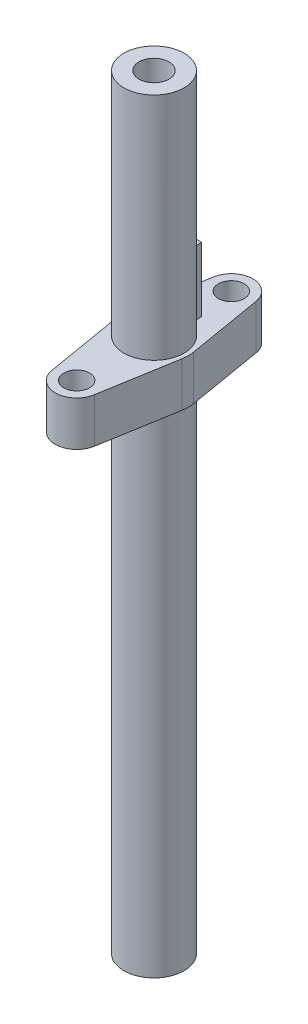
ISO-10303-21;
HEADER;
FILE_DESCRIPTION(('STEP AP214'),'2;1');
FILE_NAME('part.step','',(''),(''),'','','');
FILE_SCHEMA(('AUTOMOTIVE_DESIGN { 1 0 10303 214 1 1 1 1 }'));
ENDSEC;
DATA;
#1=APPLICATION_CONTEXT('core data for automotive mechanical design processes');
#2=APPLICATION_PROTOCOL_DEFINITION('international standard','automotive_design',2000,#1);
#3=PRODUCT_CONTEXT('',#1,'mechanical');
#4=PRODUCT('Part','Part','',(#3));
#5=PRODUCT_RELATED_PRODUCT_CATEGORY('part','',(#4));
#6=PRODUCT_DEFINITION_FORMATION('','',#4);
#7=PRODUCT_DEFINITION_CONTEXT('part definition',#1,'design');
#8=PRODUCT_DEFINITION('design','',#6,#7);
#9=PRODUCT_DEFINITION_SHAPE('','',#8);
#10=(LENGTH_UNIT() NAMED_UNIT(*) SI_UNIT(.MILLI.,.METRE.));
#11=(NAMED_UNIT(*) PLANE_ANGLE_UNIT() SI_UNIT($,.RADIAN.));
#12=(NAMED_UNIT(*) SI_UNIT($,.STERADIAN.) SOLID_ANGLE_UNIT());
#13=UNCERTAINTY_MEASURE_WITH_UNIT(LENGTH_MEASURE(1.E-05),#10,'distance_accuracy_value','');
#14=(GEOMETRIC_REPRESENTATION_CONTEXT(3) GLOBAL_UNCERTAINTY_ASSIGNED_CONTEXT((#13)) GLOBAL_UNIT_ASSIGNED_CONTEXT((#10,
#11,#12)) REPRESENTATION_CONTEXT('',''));
#15=CARTESIAN_POINT('',(0.,0.,0.));
#16=DIRECTION('',(0.,0.,1.));
#17=DIRECTION('',(1.,0.,0.));
#18=AXIS2_PLACEMENT_3D('',#15,#16,#17);
#19=CARTESIAN_POINT('',(0.,87.927,0.));
#20=DIRECTION('',(0.,-1.,0.));
#21=DIRECTION('',(0.,0.,-1.));
#22=AXIS2_PLACEMENT_3D('',#19,#20,#21);
#23=CYLINDRICAL_SURFACE('',#22,3.5);
#24=CARTESIAN_POINT('',(0.,55.977,0.));
#25=DIRECTION('',(0.,-1.,0.));
#26=DIRECTION('',(0.,0.,-1.));
#27=AXIS2_PLACEMENT_3D('',#24,#25,#26);
#28=CIRCLE('',#27,3.5);
#29=CARTESIAN_POINT('',(0.,55.977,-3.5));
#30=VERTEX_POINT('',#29);
#31=EDGE_CURVE('E293',#30,#30,#28,.T.);
#32=ORIENTED_EDGE('',*,*,#31,.T.);
#33=EDGE_LOOP('',(#32));
#34=FACE_BOUND('',#33,.T.);
#35=CARTESIAN_POINT('',(-3.03108891324554,4.677,1.75));
#36=CARTESIAN_POINT('',(-3.03109685774804,4.58581133565831,1.74999363538043));
#37=CARTESIAN_POINT('',(-3.03526652078574,4.49450752983117,1.74282494878313));
#38=CARTESIAN_POINT('',(-3.05134141291092,4.31470228681498,1.71451561732159));
#39=CARTESIAN_POINT('',(-3.06326289597229,4.22620714867404,1.69334561296981));
#40=CARTESIAN_POINT('',(-3.09311356559447,4.0549595873981,1.63817491022467));
#41=CARTESIAN_POINT('',(-3.11101076078191,3.97217935817122,1.60424241686403));
#42=CARTESIAN_POINT('',(-3.15074663429501,3.81350764650574,1.52471816940865));
#43=CARTESIAN_POINT('',(-3.17258552583113,3.7376165370407,1.4791257845626));
#44=CARTESIAN_POINT('',(-3.21994520850522,3.58796497502437,1.37316644592904));
#45=CARTESIAN_POINT('',(-3.24562111366419,3.5148965125713,1.3118910632516));
#46=CARTESIAN_POINT('',(-3.29650969874985,3.37953532028826,1.17819416332532));
#47=CARTESIAN_POINT('',(-3.32172214204687,3.31724796547884,1.10576712011901));
#48=CARTESIAN_POINT('',(-3.37087584667661,3.20110748549159,0.945856735975454));
#49=CARTESIAN_POINT('',(-3.39461686231802,3.14810590624582,0.857687580772005));
#50=CARTESIAN_POINT('',(-3.43613823174176,3.05800350681992,0.672274796549131));
#51=CARTESIAN_POINT('',(-3.45392234571548,3.02089265175995,0.575036941741771));
#52=CARTESIAN_POINT('',(-3.48040807177416,2.96636684272308,0.381578651870459));
#53=CARTESIAN_POINT('',(-3.48966590386561,2.94773832887782,0.28577813335543));
#54=CARTESIAN_POINT('',(-3.50013271730617,2.92670929231869,0.0919986002212335));
#55=CARTESIAN_POINT('',(-3.50134656873032,2.92429895060751,-0.00597906022654291));
#56=CARTESIAN_POINT('',(-3.49585218353788,2.93530667944811,-0.192206917741563));
#57=CARTESIAN_POINT('',(-3.48982367811281,2.94736652716214,-0.280562098559385));
#58=CARTESIAN_POINT('',(-3.47154929204558,2.98454147683315,-0.453799100857064));
#59=CARTESIAN_POINT('',(-3.45930294616189,3.00965755570839,-0.53868066191437));
#60=CARTESIAN_POINT('',(-3.42950270753395,3.07239449065717,-0.704041435246719));
#61=CARTESIAN_POINT('',(-3.41187772676098,3.11018354805112,-0.784443491151563));
#62=CARTESIAN_POINT('',(-3.37290880476702,3.19696097835262,-0.937959402648325));
#63=CARTESIAN_POINT('',(-3.35156353275597,3.24595336077911,-1.01107063546763));
#64=CARTESIAN_POINT('',(-3.30477690198651,3.35906686518278,-1.15530390657184));
#65=CARTESIAN_POINT('',(-3.27913907996806,3.42418029957052,-1.22558463130138));
#66=CARTESIAN_POINT('',(-3.2279509602692,3.56503201862781,-1.35468264802112));
#67=CARTESIAN_POINT('',(-3.2024007446485,3.64077840147961,-1.4134911202549));
#68=CARTESIAN_POINT('',(-3.15252273161848,3.80663433674216,-1.52163433562387));
#69=CARTESIAN_POINT('',(-3.12837559983738,3.89735054034487,-1.57013030121159));
#70=CARTESIAN_POINT('',(-3.08657037987508,4.08714092487825,-1.65080844775215));
#71=CARTESIAN_POINT('',(-3.06890552580618,4.18620625778074,-1.68300765186906));
#72=CARTESIAN_POINT('',(-3.0440311267981,4.38162539474489,-1.72756536929382));
#73=CARTESIAN_POINT('',(-3.03610397734869,4.47757195832622,-1.74129396370996));
#74=CARTESIAN_POINT('',(-3.02956358882817,4.67070234765395,-1.75265465657));
#75=CARTESIAN_POINT('',(-3.03094377056295,4.76788525095963,-1.75029812530129));
#76=CARTESIAN_POINT('',(-3.04210088946024,4.94939435751278,-1.73081307585194));
#77=CARTESIAN_POINT('',(-3.05094278136645,5.03396403943888,-1.71532867924682));
#78=CARTESIAN_POINT('',(-3.07464537714847,5.19914362597418,-1.67246849810677));
#79=CARTESIAN_POINT('',(-3.08950803008809,5.27975223880657,-1.64508886259132));
#80=CARTESIAN_POINT('',(-3.12438388639399,5.43896982907972,-1.57788328005855));
#81=CARTESIAN_POINT('',(-3.14460375675361,5.51731327949372,-1.53753961146226));
#82=CARTESIAN_POINT('',(-3.18773209120187,5.66657122519324,-1.44600236202766));
#83=CARTESIAN_POINT('',(-3.21064193371508,5.73748187614825,-1.39480320758138));
#84=CARTESIAN_POINT('',(-3.26003997298588,5.87921284316621,-1.27546504259799));
#85=CARTESIAN_POINT('',(-3.28661520520006,5.9488950137559,-1.20600422655119));
#86=CARTESIAN_POINT('',(-3.33784911211312,6.07597141648878,-1.055957866947));
#87=CARTESIAN_POINT('',(-3.36250713763491,6.13336149790345,-0.975368580646856));
#88=CARTESIAN_POINT('',(-3.40797382959175,6.23550402041268,-0.802436884477823));
#89=CARTESIAN_POINT('',(-3.42866372926051,6.27988295686909,-0.709840420754696));
#90=CARTESIAN_POINT('',(-3.46295871178777,6.35199133175044,-0.517164138121892));
#91=CARTESIAN_POINT('',(-3.47657001433653,6.37973538989103,-0.417090977436306));
#92=CARTESIAN_POINT('',(-3.49418139318295,6.41539498730566,-0.222214444078229));
#93=CARTESIAN_POINT('',(-3.49894873839335,6.4248962827832,-0.127770026738298));
#94=CARTESIAN_POINT('',(-3.5007372815648,6.4284757145452,0.0614704754146075));
#95=CARTESIAN_POINT('',(-3.49776119117057,6.42255924991624,0.156266425516403));
#96=CARTESIAN_POINT('',(-3.48484445466365,6.39652128810766,0.336941486555008));
#97=CARTESIAN_POINT('',(-3.47537565668982,6.37736151379907,0.422996556169713));
#98=CARTESIAN_POINT('',(-3.45086163910991,6.3266777512198,0.590530416321332));
#99=CARTESIAN_POINT('',(-3.43581561982392,6.29515198983646,0.672008548672141));
#100=CARTESIAN_POINT('',(-3.4007037880921,6.21922765870954,0.831990960928549));
#101=CARTESIAN_POINT('',(-3.38045080097898,6.17433618438628,0.910218999725081));
#102=CARTESIAN_POINT('',(-3.33704232998196,6.07357362099666,1.05835562317454));
#103=CARTESIAN_POINT('',(-3.31388551477131,6.01769748904757,1.12826036297609));
#104=CARTESIAN_POINT('',(-3.26425067896598,5.89010500671027,1.26509950727456));
#105=CARTESIAN_POINT('',(-3.23767148270471,5.81736564691491,1.33104594794373));
#106=CARTESIAN_POINT('',(-3.18610383284992,5.6614612380229,1.45016075294068));
#107=CARTESIAN_POINT('',(-3.16111680083264,5.57828706348155,1.5033178125176));
#108=CARTESIAN_POINT('',(-3.11499309283603,5.40038586848333,1.5967543896249));
#109=CARTESIAN_POINT('',(-3.09400304948473,5.30537682052471,1.63657386543164));
#110=CARTESIAN_POINT('',(-3.06015773574615,5.10866829240539,1.69903774163622));
#111=CARTESIAN_POINT('',(-3.04727528258478,5.0069924444028,1.72173958455686));
#112=CARTESIAN_POINT('',(-3.03676227053133,4.866340627609,1.74014226376272));
#113=CARTESIAN_POINT('',(-3.03464225759016,4.8286061848037,1.74383318368674));
#114=CARTESIAN_POINT('',(-3.03180387803563,4.75292115880607,1.74876345890743));
#115=CARTESIAN_POINT('',(-3.03108560518941,4.71497056132472,1.75000265019977));
#116=CARTESIAN_POINT('',(-3.03108891324554,4.677,1.75));
#117=B_SPLINE_CURVE_WITH_KNOTS('',3,(#35,#36,#37,#38,#39,#40,#41,#42,#43,#44,#45,#46,#47,#48,
#49,#50,#51,#52,#53,#54,#55,#56,#57,#58,#59,#60,#61,#62,#63,#64,#65,#66,#67,#68,#69,#70,#71,#72,
#73,#74,#75,#76,#77,#78,#79,#80,#81,#82,#83,#84,#85,#86,#87,#88,#89,#90,#91,#92,#93,#94,#95,#96,
#97,#98,#99,#100,#101,#102,#103,#104,#105,#106,#107,#108,#109,#110,#111,#112,#113,#114,#115,
#116),.UNSPECIFIED.,.T.,.F.,(4,2,2,2,2,2,2,2,2,2,2,2,2,2,2,2,2,2,2,2,2,2,2,2,2,2,2,2,2,2,2,2,2,
2,2,2,2,2,2,2,4),(0.,0.273406214540752,0.547387562443408,0.81992504285805,1.09247726952901,
1.38750904687191,1.68268749397649,1.99776311417836,2.31263947186809,2.60511098693886,
2.8974054145057,3.16428170597942,3.43117796905546,3.70176685779507,3.97245273862976,
4.26872585049558,4.56522584430357,4.88055473026535,5.19555354870483,5.4855900899487,
5.77542163079653,6.03354820992044,6.2917584176311,6.56192768710653,6.83223600885083,
7.13661801266073,7.44110263711853,7.7536231747269,8.0658686466535,8.34946473181602,
8.6329615188945,8.89777743525111,9.16263133646022,9.43881313759075,9.71512202676258,
10.0189292323762,10.3230039997902,10.6366881081756,10.9493148275483,11.0631523657429,
11.1769975186545),.UNSPECIFIED.);
#118=CARTESIAN_POINT('',(-3.03108891324554,4.677,1.75));
#119=VERTEX_POINT('',#118);
#120=EDGE_CURVE('E229',#119,#119,#117,.T.);
#121=ORIENTED_EDGE('',*,*,#120,.T.);
#122=EDGE_LOOP('',(#121));
#123=FACE_BOUND('',#122,.T.);
#124=CARTESIAN_POINT('',(0.,-1.1,0.));
#125=DIRECTION('',(0.,-1.,0.));
#126=DIRECTION('',(0.,0.,-1.));
#127=AXIS2_PLACEMENT_3D('',#124,#125,#126);
#128=CIRCLE('',#127,3.5);
#129=CARTESIAN_POINT('',(0.,-1.1,-3.5));
#130=VERTEX_POINT('',#129);
#131=EDGE_CURVE('E330',#130,#130,#128,.T.);
#132=ORIENTED_EDGE('',*,*,#131,.F.);
#133=EDGE_LOOP('',(#132));
#134=FACE_BOUND('',#133,.T.);
#135=ADVANCED_FACE('F45',(#34,#123,#134),#23,.T.);
#136=CARTESIAN_POINT('',(0.,8.9,0.));
#137=DIRECTION('',(0.,-1.,0.));
#138=DIRECTION('',(0.,0.,-1.));
#139=AXIS2_PLACEMENT_3D('',#136,#137,#138);
#140=CYLINDRICAL_SURFACE('',#139,1.75);
#141=CARTESIAN_POINT('',(0.,7.427,0.));
#142=DIRECTION('',(0.,-1.,0.));
#143=DIRECTION('',(0.,0.,-1.));
#144=AXIS2_PLACEMENT_3D('',#141,#142,#143);
#145=CIRCLE('',#144,1.75);
#146=CARTESIAN_POINT('',(0.,7.427,-1.75));
#147=VERTEX_POINT('',#146);
#148=EDGE_CURVE('E651',#147,#147,#145,.T.);
#149=ORIENTED_EDGE('',*,*,#148,.F.);
#150=EDGE_LOOP('',(#149));
#151=FACE_BOUND('',#150,.T.);
#152=CARTESIAN_POINT('',(0.,4.677,0.));
#153=DIRECTION('',(-0.707106781186547,0.707106781186547,0.));
#154=DIRECTION('',(-0.707106781186547,-0.707106781186547,0.));
#155=AXIS2_PLACEMENT_3D('',#152,#153,#154);
#156=ELLIPSE('',#155,2.47487373415292,1.75);
#157=CARTESIAN_POINT('',(0.,4.677,1.75));
#158=VERTEX_POINT('',#157);
#159=CARTESIAN_POINT('',(0.,4.677,-1.75));
#160=VERTEX_POINT('',#159);
#161=EDGE_CURVE('E213',#158,#160,#156,.F.);
#162=ORIENTED_EDGE('',*,*,#161,.F.);
#163=CARTESIAN_POINT('',(0.,4.677,0.));
#164=DIRECTION('',(-0.707106781186547,-0.707106781186547,0.));
#165=DIRECTION('',(-0.707106781186547,0.707106781186547,0.));
#166=AXIS2_PLACEMENT_3D('',#163,#164,#165);
#167=ELLIPSE('',#166,2.47487373415292,1.75);
#168=EDGE_CURVE('E68',#160,#158,#167,.F.);
#169=ORIENTED_EDGE('',*,*,#168,.F.);
#170=EDGE_LOOP('',(#162,#169));
#171=FACE_BOUND('',#170,.T.);
#172=CARTESIAN_POINT('',(0.,-1.1,0.));
#173=DIRECTION('',(0.,-1.,0.));
#174=DIRECTION('',(0.,0.,-1.));
#175=AXIS2_PLACEMENT_3D('',#172,#173,#174);
#176=CIRCLE('',#175,1.75);
#177=CARTESIAN_POINT('',(0.,-1.1,-1.75));
#178=VERTEX_POINT('',#177);
#179=EDGE_CURVE('E326',#178,#178,#176,.F.);
#180=ORIENTED_EDGE('',*,*,#179,.F.);
#181=EDGE_LOOP('',(#180));
#182=FACE_BOUND('',#181,.T.);
#183=ADVANCED_FACE('F250',(#151,#171,#182),#140,.F.);
#184=CARTESIAN_POINT('',(3.501,4.677,0.));
#185=DIRECTION('',(-1.,0.,0.));
#186=DIRECTION('',(0.,0.,1.));
#187=AXIS2_PLACEMENT_3D('',#184,#185,#186);
#188=CYLINDRICAL_SURFACE('',#187,1.75);
#189=ORIENTED_EDGE('',*,*,#161,.T.);
#190=ORIENTED_EDGE('',*,*,#168,.T.);
#191=EDGE_LOOP('',(#189,#190));
#192=FACE_BOUND('',#191,.T.);
#193=ORIENTED_EDGE('',*,*,#120,.F.);
#194=EDGE_LOOP('',(#193));
#195=FACE_BOUND('',#194,.T.);
#196=ADVANCED_FACE('F242',(#192,#195),#188,.F.);
#197=CARTESIAN_POINT('',(0.,55.977,0.));
#198=DIRECTION('',(0.,-1.,0.));
#199=DIRECTION('',(0.,0.,-1.));
#200=AXIS2_PLACEMENT_3D('',#197,#198,#199);
#201=PLANE('',#200);
#202=ORIENTED_EDGE('',*,*,#31,.F.);
#203=EDGE_LOOP('',(#202));
#204=FACE_BOUND('',#203,.T.);
#205=CARTESIAN_POINT('',(0.,55.977,0.));
#206=DIRECTION('',(0.,-1.,0.));
#207=DIRECTION('',(0.,0.,-1.));
#208=AXIS2_PLACEMENT_3D('',#205,#206,#207);
#209=CIRCLE('',#208,4.);
#210=CARTESIAN_POINT('',(-3.94405318873308,55.977,0.666666666666666));
#211=VERTEX_POINT('',#210);
#212=CARTESIAN_POINT('',(-3.94405318873308,55.977,-0.666666666666668));
#213=VERTEX_POINT('',#212);
#214=EDGE_CURVE('E160',#211,#213,#209,.T.);
#215=ORIENTED_EDGE('',*,*,#214,.T.);
#216=DIRECTION('',(0.166666666666667,0.,-0.986013297183269));
#217=VECTOR('',#216,1.);
#218=CARTESIAN_POINT('',(-3.94405318873308,55.977,-0.666666666666668));
#219=LINE('',#218,#217);
#220=CARTESIAN_POINT('',(-2.46503324295805,55.977,-9.41666666666665));
#221=VERTEX_POINT('',#220);
#222=EDGE_CURVE('E148',#213,#221,#219,.T.);
#223=ORIENTED_EDGE('',*,*,#222,.T.);
#224=CARTESIAN_POINT('',(1.2490009027033E-13,55.977,-9.));
#225=DIRECTION('',(0.,-1.,0.));
#226=DIRECTION('',(0.,0.,1.));
#227=AXIS2_PLACEMENT_3D('',#224,#225,#226);
#228=CIRCLE('',#227,2.5);
#229=CARTESIAN_POINT('',(2.46503324295818,55.977,-9.41666666666667));
#230=VERTEX_POINT('',#229);
#231=EDGE_CURVE('E159',#221,#230,#228,.T.);
#232=ORIENTED_EDGE('',*,*,#231,.T.);
#233=DIRECTION('',(0.166666666666666,0.,0.986013297183269));
#234=VECTOR('',#233,1.);
#235=CARTESIAN_POINT('',(2.46503324295818,55.977,-9.41666666666667));
#236=LINE('',#235,#234);
#237=CARTESIAN_POINT('',(3.94405318873308,55.977,-0.666666666666666));
#238=VERTEX_POINT('',#237);
#239=EDGE_CURVE('E356',#230,#238,#236,.T.);
#240=ORIENTED_EDGE('',*,*,#239,.T.);
#241=CARTESIAN_POINT('',(0.,55.977,0.));
#242=DIRECTION('',(0.,-1.,0.));
#243=DIRECTION('',(0.,0.,-1.));
#244=AXIS2_PLACEMENT_3D('',#241,#242,#243);
#245=CIRCLE('',#244,4.);
#246=CARTESIAN_POINT('',(3.94405318873308,55.977,0.666666666666666));
#247=VERTEX_POINT('',#246);
#248=EDGE_CURVE('E359',#238,#247,#245,.T.);
#249=ORIENTED_EDGE('',*,*,#248,.T.);
#250=DIRECTION('',(-0.166666666666667,0.,0.986013297183269));
#251=VECTOR('',#250,1.);
#252=CARTESIAN_POINT('',(2.46503324295817,55.977,9.41666666666667));
#253=LINE('',#252,#251);
#254=CARTESIAN_POINT('',(2.46503324295817,55.977,9.41666666666667));
#255=VERTEX_POINT('',#254);
#256=EDGE_CURVE('E362',#247,#255,#253,.T.);
#257=ORIENTED_EDGE('',*,*,#256,.T.);
#258=CARTESIAN_POINT('',(0.,55.977,9.));
#259=DIRECTION('',(0.,-1.,0.));
#260=DIRECTION('',(0.,0.,-1.));
#261=AXIS2_PLACEMENT_3D('',#258,#259,#260);
#262=CIRCLE('',#261,2.5);
#263=CARTESIAN_POINT('',(-2.46503324295817,55.977,9.41666666666667));
#264=VERTEX_POINT('',#263);
#265=EDGE_CURVE('E365',#255,#264,#262,.T.);
#266=ORIENTED_EDGE('',*,*,#265,.T.);
#267=DIRECTION('',(-0.166666666666667,0.,-0.986013297183269));
#268=VECTOR('',#267,1.);
#269=CARTESIAN_POINT('',(-3.94405318873308,55.977,0.666666666666666));
#270=LINE('',#269,#268);
#271=EDGE_CURVE('E166',#264,#211,#270,.T.);
#272=ORIENTED_EDGE('',*,*,#271,.T.);
#273=EDGE_LOOP('',(#215,#223,#232,#240,#249,#257,#266,#272));
#274=FACE_BOUND('',#273,.T.);
#275=CARTESIAN_POINT('',(0.,55.977,9.));
#276=DIRECTION('',(0.,-1.,0.));
#277=DIRECTION('',(0.,0.,-1.));
#278=AXIS2_PLACEMENT_3D('',#275,#276,#277);
#279=CIRCLE('',#278,1.5);
#280=CARTESIAN_POINT('',(0.,55.977,7.5));
#281=VERTEX_POINT('',#280);
#282=EDGE_CURVE('E347',#281,#281,#279,.T.);
#283=ORIENTED_EDGE('',*,*,#282,.F.);
#284=EDGE_LOOP('',(#283));
#285=FACE_BOUND('',#284,.T.);
#286=CARTESIAN_POINT('',(1.2490009027033E-13,55.977,-9.));
#287=DIRECTION('',(0.,-1.,0.));
#288=DIRECTION('',(0.,0.,1.));
#289=AXIS2_PLACEMENT_3D('',#286,#287,#288);
#290=CIRCLE('',#289,1.5);
#291=CARTESIAN_POINT('',(1.2490009027033E-13,55.977,-7.5));
#292=VERTEX_POINT('',#291);
#293=EDGE_CURVE('E294',#292,#292,#290,.T.);
#294=ORIENTED_EDGE('',*,*,#293,.F.);
#295=EDGE_LOOP('',(#294));
#296=FACE_BOUND('',#295,.T.);
#297=ADVANCED_FACE('F163',(#204,#274,#285,#296),#201,.T.);
#298=CARTESIAN_POINT('',(0.,61.177,0.));
#299=DIRECTION('',(0.,-1.,0.));
#300=DIRECTION('',(0.,0.,-1.));
#301=AXIS2_PLACEMENT_3D('',#298,#299,#300);
#302=PLANE('',#301);
#303=DIRECTION('',(0.,0.,1.));
#304=VECTOR('',#303,1.);
#305=CARTESIAN_POINT('',(-0.850000000000001,61.177,-3.24037034920393));
#306=LINE('',#305,#304);
#307=CARTESIAN_POINT('',(-0.850000000000001,61.177,-4.70410196624969));
#308=VERTEX_POINT('',#307);
#309=CARTESIAN_POINT('',(-0.850000000000001,61.177,-3.39521722427299));
#310=VERTEX_POINT('',#309);
#311=EDGE_CURVE('E195',#308,#310,#306,.T.);
#312=ORIENTED_EDGE('',*,*,#311,.F.);
#313=DIRECTION('',(-1.,0.,0.));
#314=VECTOR('',#313,1.);
#315=CARTESIAN_POINT('',(-0.850000000000001,61.177,-4.70410196624969));
#316=LINE('',#315,#314);
#317=CARTESIAN_POINT('',(0.850000000000001,61.177,-4.70410196624969));
#318=VERTEX_POINT('',#317);
#319=EDGE_CURVE('E191',#318,#308,#316,.T.);
#320=ORIENTED_EDGE('',*,*,#319,.F.);
#321=DIRECTION('',(0.,0.,-1.));
#322=VECTOR('',#321,1.);
#323=CARTESIAN_POINT('',(0.850000000000003,61.177,-3.24037034920393));
#324=LINE('',#323,#322);
#325=CARTESIAN_POINT('',(0.850000000000003,61.177,-3.39521722427299));
#326=VERTEX_POINT('',#325);
#327=EDGE_CURVE('E187',#326,#318,#324,.T.);
#328=ORIENTED_EDGE('',*,*,#327,.F.);
#329=CARTESIAN_POINT('',(0.,61.177,0.));
#330=DIRECTION('',(0.,-1.,0.));
#331=DIRECTION('',(0.,0.,-1.));
#332=AXIS2_PLACEMENT_3D('',#329,#330,#331);
#333=CIRCLE('',#332,3.5);
#334=EDGE_CURVE('E288',#326,#310,#333,.T.);
#335=ORIENTED_EDGE('',*,*,#334,.T.);
#336=EDGE_LOOP('',(#312,#320,#328,#335));
#337=FACE_BOUND('',#336,.T.);
#338=CARTESIAN_POINT('',(0.,61.177,0.));
#339=DIRECTION('',(0.,-1.,0.));
#340=DIRECTION('',(0.,0.,-1.));
#341=AXIS2_PLACEMENT_3D('',#338,#339,#340);
#342=CIRCLE('',#341,4.);
#343=CARTESIAN_POINT('',(-3.94405318873308,61.177,0.666666666666666));
#344=VERTEX_POINT('',#343);
#345=CARTESIAN_POINT('',(-3.94405318873308,61.177,-0.666666666666668));
#346=VERTEX_POINT('',#345);
#347=EDGE_CURVE('E175',#344,#346,#342,.T.);
#348=ORIENTED_EDGE('',*,*,#347,.F.);
#349=DIRECTION('',(-0.166666666666667,0.,-0.986013297183269));
#350=VECTOR('',#349,1.);
#351=CARTESIAN_POINT('',(-3.94405318873308,61.177,0.666666666666666));
#352=LINE('',#351,#350);
#353=CARTESIAN_POINT('',(-2.46503324295817,61.177,9.41666666666667));
#354=VERTEX_POINT('',#353);
#355=EDGE_CURVE('E171',#354,#344,#352,.T.);
#356=ORIENTED_EDGE('',*,*,#355,.F.);
#357=CARTESIAN_POINT('',(0.,61.177,9.));
#358=DIRECTION('',(0.,-1.,0.));
#359=DIRECTION('',(0.,0.,-1.));
#360=AXIS2_PLACEMENT_3D('',#357,#358,#359);
#361=CIRCLE('',#360,2.5);
#362=CARTESIAN_POINT('',(2.46503324295817,61.177,9.41666666666667));
#363=VERTEX_POINT('',#362);
#364=EDGE_CURVE('E388',#363,#354,#361,.T.);
#365=ORIENTED_EDGE('',*,*,#364,.F.);
#366=DIRECTION('',(-0.166666666666667,0.,0.986013297183269));
#367=VECTOR('',#366,1.);
#368=CARTESIAN_POINT('',(2.46503324295817,61.177,9.41666666666667));
#369=LINE('',#368,#367);
#370=CARTESIAN_POINT('',(3.94405318873308,61.177,0.666666666666666));
#371=VERTEX_POINT('',#370);
#372=EDGE_CURVE('E385',#371,#363,#369,.T.);
#373=ORIENTED_EDGE('',*,*,#372,.F.);
#374=CARTESIAN_POINT('',(0.,61.177,0.));
#375=DIRECTION('',(0.,-1.,0.));
#376=DIRECTION('',(0.,0.,-1.));
#377=AXIS2_PLACEMENT_3D('',#374,#375,#376);
#378=CIRCLE('',#377,4.);
#379=CARTESIAN_POINT('',(3.94405318873308,61.177,-0.666666666666666));
#380=VERTEX_POINT('',#379);
#381=EDGE_CURVE('E382',#380,#371,#378,.T.);
#382=ORIENTED_EDGE('',*,*,#381,.F.);
#383=DIRECTION('',(0.166666666666666,0.,0.986013297183269));
#384=VECTOR('',#383,1.);
#385=CARTESIAN_POINT('',(2.46503324295818,61.177,-9.41666666666667));
#386=LINE('',#385,#384);
#387=CARTESIAN_POINT('',(2.46503324295818,61.177,-9.41666666666667));
#388=VERTEX_POINT('',#387);
#389=EDGE_CURVE('E379',#388,#380,#386,.T.);
#390=ORIENTED_EDGE('',*,*,#389,.F.);
#391=CARTESIAN_POINT('',(1.2490009027033E-13,61.177,-9.));
#392=DIRECTION('',(0.,-1.,0.));
#393=DIRECTION('',(0.,0.,1.));
#394=AXIS2_PLACEMENT_3D('',#391,#392,#393);
#395=CIRCLE('',#394,2.5);
#396=CARTESIAN_POINT('',(-2.46503324295805,61.177,-9.41666666666665));
#397=VERTEX_POINT('',#396);
#398=EDGE_CURVE('E376',#397,#388,#395,.T.);
#399=ORIENTED_EDGE('',*,*,#398,.F.);
#400=DIRECTION('',(0.166666666666667,0.,-0.986013297183269));
#401=VECTOR('',#400,1.);
#402=CARTESIAN_POINT('',(-3.94405318873308,61.177,-0.666666666666668));
#403=LINE('',#402,#401);
#404=EDGE_CURVE('E373',#346,#397,#403,.T.);
#405=ORIENTED_EDGE('',*,*,#404,.F.);
#406=EDGE_LOOP('',(#348,#356,#365,#373,#382,#390,#399,#405));
#407=FACE_BOUND('',#406,.T.);
#408=CARTESIAN_POINT('',(0.,61.177,9.));
#409=DIRECTION('',(0.,-1.,0.));
#410=DIRECTION('',(0.,0.,-1.));
#411=AXIS2_PLACEMENT_3D('',#408,#409,#410);
#412=CIRCLE('',#411,1.5);
#413=CARTESIAN_POINT('',(0.,61.177,7.5));
#414=VERTEX_POINT('',#413);
#415=EDGE_CURVE('E345',#414,#414,#412,.T.);
#416=ORIENTED_EDGE('',*,*,#415,.T.);
#417=EDGE_LOOP('',(#416));
#418=FACE_BOUND('',#417,.T.);
#419=CARTESIAN_POINT('',(1.2490009027033E-13,61.177,-9.));
#420=DIRECTION('',(0.,-1.,0.));
#421=DIRECTION('',(0.,0.,1.));
#422=AXIS2_PLACEMENT_3D('',#419,#420,#421);
#423=CIRCLE('',#422,1.5);
#424=CARTESIAN_POINT('',(1.2490009027033E-13,61.177,-7.5));
#425=VERTEX_POINT('',#424);
#426=EDGE_CURVE('E329',#425,#425,#423,.T.);
#427=ORIENTED_EDGE('',*,*,#426,.T.);
#428=EDGE_LOOP('',(#427));
#429=FACE_BOUND('',#428,.T.);
#430=ADVANCED_FACE('F319',(#337,#407,#418,#429),#302,.F.);
#431=CARTESIAN_POINT('',(0.,55.977,0.));
#432=DIRECTION('',(0.,1.,0.));
#433=DIRECTION('',(0.,0.,1.));
#434=AXIS2_PLACEMENT_3D('',#431,#432,#433);
#435=CYLINDRICAL_SURFACE('',#434,4.);
#436=ORIENTED_EDGE('',*,*,#347,.T.);
#437=DIRECTION('',(0.,1.,0.));
#438=VECTOR('',#437,1.);
#439=CARTESIAN_POINT('',(-3.94405318873308,55.977,-0.666666666666668));
#440=LINE('',#439,#438);
#441=EDGE_CURVE('E152',#213,#346,#440,.T.);
#442=ORIENTED_EDGE('',*,*,#441,.F.);
#443=ORIENTED_EDGE('',*,*,#214,.F.);
#444=DIRECTION('',(0.,1.,0.));
#445=VECTOR('',#444,1.);
#446=CARTESIAN_POINT('',(-3.94405318873308,55.977,0.666666666666666));
#447=LINE('',#446,#445);
#448=EDGE_CURVE('E370',#211,#344,#447,.T.);
#449=ORIENTED_EDGE('',*,*,#448,.T.);
#450=EDGE_LOOP('',(#436,#442,#443,#449));
#451=FACE_BOUND('',#450,.T.);
#452=ADVANCED_FACE('F173',(#451),#435,.T.);
#453=CARTESIAN_POINT('',(-3.94405318873308,55.977,-0.666666666666668));
#454=DIRECTION('',(0.986013297183269,0.,0.166666666666667));
#455=DIRECTION('',(0.166666666666667,0.,-0.986013297183269));
#456=AXIS2_PLACEMENT_3D('',#453,#454,#455);
#457=PLANE('',#456);
#458=ORIENTED_EDGE('',*,*,#404,.T.);
#459=DIRECTION('',(0.,1.,0.));
#460=VECTOR('',#459,1.);
#461=CARTESIAN_POINT('',(-2.46503324295805,55.977,-9.41666666666665));
#462=LINE('',#461,#460);
#463=EDGE_CURVE('E155',#221,#397,#462,.T.);
#464=ORIENTED_EDGE('',*,*,#463,.F.);
#465=ORIENTED_EDGE('',*,*,#222,.F.);
#466=ORIENTED_EDGE('',*,*,#441,.T.);
#467=EDGE_LOOP('',(#458,#464,#465,#466));
#468=FACE_BOUND('',#467,.T.);
#469=ADVANCED_FACE('F150',(#468),#457,.F.);
#470=CARTESIAN_POINT('',(1.2490009027033E-13,55.977,-9.));
#471=DIRECTION('',(0.,1.,0.));
#472=DIRECTION('',(0.,0.,1.));
#473=AXIS2_PLACEMENT_3D('',#470,#471,#472);
#474=CYLINDRICAL_SURFACE('',#473,2.5);
#475=ORIENTED_EDGE('',*,*,#398,.T.);
#476=DIRECTION('',(0.,1.,0.));
#477=VECTOR('',#476,1.);
#478=CARTESIAN_POINT('',(2.46503324295818,55.977,-9.41666666666667));
#479=LINE('',#478,#477);
#480=EDGE_CURVE('E183',#230,#388,#479,.T.);
#481=ORIENTED_EDGE('',*,*,#480,.F.);
#482=ORIENTED_EDGE('',*,*,#231,.F.);
#483=ORIENTED_EDGE('',*,*,#463,.T.);
#484=EDGE_LOOP('',(#475,#481,#482,#483));
#485=FACE_BOUND('',#484,.T.);
#486=ADVANCED_FACE('F435',(#485),#474,.T.);
#487=CARTESIAN_POINT('',(2.46503324295818,55.977,-9.41666666666667));
#488=DIRECTION('',(-0.986013297183269,0.,0.166666666666666));
#489=DIRECTION('',(0.166666666666666,0.,0.986013297183269));
#490=AXIS2_PLACEMENT_3D('',#487,#488,#489);
#491=PLANE('',#490);
#492=ORIENTED_EDGE('',*,*,#389,.T.);
#493=DIRECTION('',(0.,1.,0.));
#494=VECTOR('',#493,1.);
#495=CARTESIAN_POINT('',(3.94405318873308,55.977,-0.666666666666666));
#496=LINE('',#495,#494);
#497=EDGE_CURVE('E407',#238,#380,#496,.T.);
#498=ORIENTED_EDGE('',*,*,#497,.F.);
#499=ORIENTED_EDGE('',*,*,#239,.F.);
#500=ORIENTED_EDGE('',*,*,#480,.T.);
#501=EDGE_LOOP('',(#492,#498,#499,#500));
#502=FACE_BOUND('',#501,.T.);
#503=ADVANCED_FACE('F416',(#502),#491,.F.);
#504=CARTESIAN_POINT('',(0.,55.977,0.));
#505=DIRECTION('',(0.,1.,0.));
#506=DIRECTION('',(0.,0.,1.));
#507=AXIS2_PLACEMENT_3D('',#504,#505,#506);
#508=CYLINDRICAL_SURFACE('',#507,4.);
#509=ORIENTED_EDGE('',*,*,#381,.T.);
#510=DIRECTION('',(0.,1.,0.));
#511=VECTOR('',#510,1.);
#512=CARTESIAN_POINT('',(3.94405318873308,55.977,0.666666666666666));
#513=LINE('',#512,#511);
#514=EDGE_CURVE('E403',#247,#371,#513,.T.);
#515=ORIENTED_EDGE('',*,*,#514,.F.);
#516=ORIENTED_EDGE('',*,*,#248,.F.);
#517=ORIENTED_EDGE('',*,*,#497,.T.);
#518=EDGE_LOOP('',(#509,#515,#516,#517));
#519=FACE_BOUND('',#518,.T.);
#520=ADVANCED_FACE('F427',(#519),#508,.T.);
#521=CARTESIAN_POINT('',(2.46503324295817,55.977,9.41666666666667));
#522=DIRECTION('',(-0.986013297183269,0.,-0.166666666666667));
#523=DIRECTION('',(-0.166666666666667,0.,0.986013297183269));
#524=AXIS2_PLACEMENT_3D('',#521,#522,#523);
#525=PLANE('',#524);
#526=ORIENTED_EDGE('',*,*,#372,.T.);
#527=DIRECTION('',(0.,1.,0.));
#528=VECTOR('',#527,1.);
#529=CARTESIAN_POINT('',(2.46503324295817,55.977,9.41666666666667));
#530=LINE('',#529,#528);
#531=EDGE_CURVE('E399',#255,#363,#530,.T.);
#532=ORIENTED_EDGE('',*,*,#531,.F.);
#533=ORIENTED_EDGE('',*,*,#256,.F.);
#534=ORIENTED_EDGE('',*,*,#514,.T.);
#535=EDGE_LOOP('',(#526,#532,#533,#534));
#536=FACE_BOUND('',#535,.T.);
#537=ADVANCED_FACE('F431',(#536),#525,.F.);
#538=CARTESIAN_POINT('',(0.,55.977,9.));
#539=DIRECTION('',(0.,1.,0.));
#540=DIRECTION('',(0.,0.,1.));
#541=AXIS2_PLACEMENT_3D('',#538,#539,#540);
#542=CYLINDRICAL_SURFACE('',#541,2.5);
#543=ORIENTED_EDGE('',*,*,#364,.T.);
#544=DIRECTION('',(0.,1.,0.));
#545=VECTOR('',#544,1.);
#546=CARTESIAN_POINT('',(-2.46503324295817,55.977,9.41666666666667));
#547=LINE('',#546,#545);
#548=EDGE_CURVE('E395',#264,#354,#547,.T.);
#549=ORIENTED_EDGE('',*,*,#548,.F.);
#550=ORIENTED_EDGE('',*,*,#265,.F.);
#551=ORIENTED_EDGE('',*,*,#531,.T.);
#552=EDGE_LOOP('',(#543,#549,#550,#551));
#553=FACE_BOUND('',#552,.T.);
#554=ADVANCED_FACE('F544',(#553),#542,.T.);
#555=CARTESIAN_POINT('',(-3.94405318873308,55.977,0.666666666666666));
#556=DIRECTION('',(0.986013297183269,0.,-0.166666666666667));
#557=DIRECTION('',(-0.166666666666667,0.,-0.986013297183269));
#558=AXIS2_PLACEMENT_3D('',#555,#556,#557);
#559=PLANE('',#558);
#560=ORIENTED_EDGE('',*,*,#355,.T.);
#561=ORIENTED_EDGE('',*,*,#448,.F.);
#562=ORIENTED_EDGE('',*,*,#271,.F.);
#563=ORIENTED_EDGE('',*,*,#548,.T.);
#564=EDGE_LOOP('',(#560,#561,#562,#563));
#565=FACE_BOUND('',#564,.T.);
#566=ADVANCED_FACE('F537',(#565),#559,.F.);
#567=CARTESIAN_POINT('',(0.,55.977,9.));
#568=DIRECTION('',(0.,1.,0.));
#569=DIRECTION('',(0.,0.,1.));
#570=AXIS2_PLACEMENT_3D('',#567,#568,#569);
#571=CYLINDRICAL_SURFACE('',#570,1.5);
#572=ORIENTED_EDGE('',*,*,#282,.T.);
#573=EDGE_LOOP('',(#572));
#574=FACE_BOUND('',#573,.T.);
#575=ORIENTED_EDGE('',*,*,#415,.F.);
#576=EDGE_LOOP('',(#575));
#577=FACE_BOUND('',#576,.T.);
#578=ADVANCED_FACE('F534',(#574,#577),#571,.F.);
#579=CARTESIAN_POINT('',(1.2490009027033E-13,55.977,-9.));
#580=DIRECTION('',(0.,1.,0.));
#581=DIRECTION('',(0.,0.,1.));
#582=AXIS2_PLACEMENT_3D('',#579,#580,#581);
#583=CYLINDRICAL_SURFACE('',#582,1.5);
#584=ORIENTED_EDGE('',*,*,#293,.T.);
#585=EDGE_LOOP('',(#584));
#586=FACE_BOUND('',#585,.T.);
#587=ORIENTED_EDGE('',*,*,#426,.F.);
#588=EDGE_LOOP('',(#587));
#589=FACE_BOUND('',#588,.T.);
#590=ADVANCED_FACE('F248',(#586,#589),#583,.F.);
#591=CARTESIAN_POINT('',(0.,79.027,0.));
#592=DIRECTION('',(0.,1.,0.));
#593=DIRECTION('',(0.,0.,1.));
#594=AXIS2_PLACEMENT_3D('',#591,#592,#593);
#595=CYLINDRICAL_SURFACE('',#594,1.75);
#596=CARTESIAN_POINT('',(0.,79.427,0.));
#597=DIRECTION('',(0.,1.,0.));
#598=DIRECTION('',(0.,0.,1.));
#599=AXIS2_PLACEMENT_3D('',#596,#597,#598);
#600=CIRCLE('',#599,1.75);
#601=CARTESIAN_POINT('',(0.,79.427,1.75));
#602=VERTEX_POINT('',#601);
#603=EDGE_CURVE('E337',#602,#602,#600,.T.);
#604=ORIENTED_EDGE('',*,*,#603,.F.);
#605=EDGE_LOOP('',(#604));
#606=FACE_BOUND('',#605,.T.);
#607=CARTESIAN_POINT('',(0.,82.177,0.));
#608=DIRECTION('',(-0.707106781186547,-0.707106781186547,0.));
#609=DIRECTION('',(-0.707106781186547,0.707106781186547,0.));
#610=AXIS2_PLACEMENT_3D('',#607,#608,#609);
#611=ELLIPSE('',#610,2.47487373415292,1.75);
#612=CARTESIAN_POINT('',(0.,82.177,-1.75));
#613=VERTEX_POINT('',#612);
#614=CARTESIAN_POINT('',(0.,82.177,1.75));
#615=VERTEX_POINT('',#614);
#616=EDGE_CURVE('E214',#613,#615,#611,.F.);
#617=ORIENTED_EDGE('',*,*,#616,.F.);
#618=CARTESIAN_POINT('',(0.,82.177,0.));
#619=DIRECTION('',(-0.707106781186547,0.707106781186547,0.));
#620=DIRECTION('',(-0.707106781186547,-0.707106781186547,0.));
#621=AXIS2_PLACEMENT_3D('',#618,#619,#620);
#622=ELLIPSE('',#621,2.47487373415292,1.75);
#623=EDGE_CURVE('E207',#615,#613,#622,.F.);
#624=ORIENTED_EDGE('',*,*,#623,.F.);
#625=EDGE_LOOP('',(#617,#624));
#626=FACE_BOUND('',#625,.T.);
#627=CARTESIAN_POINT('',(0.,87.927,0.));
#628=DIRECTION('',(0.,1.,0.));
#629=DIRECTION('',(0.,0.,1.));
#630=AXIS2_PLACEMENT_3D('',#627,#628,#629);
#631=CIRCLE('',#630,1.75);
#632=CARTESIAN_POINT('',(0.,87.927,1.75));
#633=VERTEX_POINT('',#632);
#634=EDGE_CURVE('E305',#633,#633,#631,.T.);
#635=ORIENTED_EDGE('',*,*,#634,.T.);
#636=EDGE_LOOP('',(#635));
#637=FACE_BOUND('',#636,.T.);
#638=ADVANCED_FACE('F245',(#606,#626,#637),#595,.F.);
#639=CARTESIAN_POINT('',(0.,87.927,0.));
#640=DIRECTION('',(0.,1.,0.));
#641=DIRECTION('',(0.,0.,1.));
#642=AXIS2_PLACEMENT_3D('',#639,#640,#641);
#643=PLANE('',#642);
#644=ORIENTED_EDGE('',*,*,#634,.F.);
#645=EDGE_LOOP('',(#644));
#646=FACE_BOUND('',#645,.T.);
#647=CARTESIAN_POINT('',(0.,87.927,0.));
#648=DIRECTION('',(0.,1.,0.));
#649=DIRECTION('',(0.,0.,1.));
#650=AXIS2_PLACEMENT_3D('',#647,#648,#649);
#651=CIRCLE('',#650,3.5);
#652=CARTESIAN_POINT('',(0.,87.927,3.5));
#653=VERTEX_POINT('',#652);
#654=EDGE_CURVE('E285',#653,#653,#651,.T.);
#655=ORIENTED_EDGE('',*,*,#654,.T.);
#656=EDGE_LOOP('',(#655));
#657=FACE_BOUND('',#656,.T.);
#658=ADVANCED_FACE('F240',(#646,#657),#643,.T.);
#659=CARTESIAN_POINT('',(3.501,82.177,0.));
#660=DIRECTION('',(-1.,0.,0.));
#661=DIRECTION('',(0.,0.,1.));
#662=AXIS2_PLACEMENT_3D('',#659,#660,#661);
#663=CYLINDRICAL_SURFACE('',#662,1.75);
#664=ORIENTED_EDGE('',*,*,#623,.T.);
#665=ORIENTED_EDGE('',*,*,#616,.T.);
#666=EDGE_LOOP('',(#664,#665));
#667=FACE_BOUND('',#666,.T.);
#668=CARTESIAN_POINT('',(-3.03108891324553,82.177,1.75));
#669=CARTESIAN_POINT('',(-3.03109685774803,82.0858113356583,1.74999363538043));
#670=CARTESIAN_POINT('',(-3.03526652078574,81.9945075298312,1.74282494878313));
#671=CARTESIAN_POINT('',(-3.05134141291091,81.814702286815,1.7145156173216));
#672=CARTESIAN_POINT('',(-3.06326289597229,81.726207148674,1.69334561296982));
#673=CARTESIAN_POINT('',(-3.09311356559447,81.5549595873981,1.63817491022468));
#674=CARTESIAN_POINT('',(-3.11101076078191,81.4721793581712,1.60424241686404));
#675=CARTESIAN_POINT('',(-3.150746634295,81.3135076465058,1.52471816940866));
#676=CARTESIAN_POINT('',(-3.17258552583112,81.2376165370407,1.47912578456261));
#677=CARTESIAN_POINT('',(-3.21994520850522,81.0879649750244,1.37316644592905));
#678=CARTESIAN_POINT('',(-3.24562111366418,81.0148965125713,1.31189106325161));
#679=CARTESIAN_POINT('',(-3.29650969874984,80.8795353202883,1.17819416332533));
#680=CARTESIAN_POINT('',(-3.32172214204687,80.8172479654788,1.10576712011902));
#681=CARTESIAN_POINT('',(-3.37087584667661,80.7011074854916,0.945856735975462));
#682=CARTESIAN_POINT('',(-3.39461686231802,80.6481059062458,0.85768758077201));
#683=CARTESIAN_POINT('',(-3.43613823174176,80.5580035068199,0.672274796549137));
#684=CARTESIAN_POINT('',(-3.45392234571548,80.52089265176,0.575036941741779));
#685=CARTESIAN_POINT('',(-3.48040807177415,80.4663668427231,0.381578651870468));
#686=CARTESIAN_POINT('',(-3.48966590386561,80.4477383288778,0.285778133355437));
#687=CARTESIAN_POINT('',(-3.50013271730617,80.4267092923187,0.0919986002212391));
#688=CARTESIAN_POINT('',(-3.50134656873032,80.4242989506075,-0.00597906022653776));
#689=CARTESIAN_POINT('',(-3.49585218353788,80.4353066794481,-0.192206917741558));
#690=CARTESIAN_POINT('',(-3.48982367811281,80.4473665271621,-0.28056209855938));
#691=CARTESIAN_POINT('',(-3.47154929204558,80.4845414768331,-0.453799100857058));
#692=CARTESIAN_POINT('',(-3.45930294616189,80.5096575557084,-0.538680661914365));
#693=CARTESIAN_POINT('',(-3.42950270753395,80.5723944906572,-0.704041435246714));
#694=CARTESIAN_POINT('',(-3.41187772676099,80.6101835480511,-0.784443491151558));
#695=CARTESIAN_POINT('',(-3.37290880476703,80.6969609783526,-0.937959402648322));
#696=CARTESIAN_POINT('',(-3.35156353275597,80.7459533607791,-1.01107063546763));
#697=CARTESIAN_POINT('',(-3.30477690198651,80.8590668651828,-1.15530390657184));
#698=CARTESIAN_POINT('',(-3.27913907996807,80.9241802995705,-1.22558463130138));
#699=CARTESIAN_POINT('',(-3.2279509602692,81.0650320186278,-1.35468264802111));
#700=CARTESIAN_POINT('',(-3.2024007446485,81.1407784014796,-1.4134911202549));
#701=CARTESIAN_POINT('',(-3.15252273161848,81.3066343367421,-1.52163433562387));
#702=CARTESIAN_POINT('',(-3.12837559983738,81.3973505403449,-1.57013030121159));
#703=CARTESIAN_POINT('',(-3.08657037987508,81.5871409248782,-1.65080844775216));
#704=CARTESIAN_POINT('',(-3.06890552580618,81.6862062577807,-1.68300765186906));
#705=CARTESIAN_POINT('',(-3.0440311267981,81.8816253947449,-1.72756536929383));
#706=CARTESIAN_POINT('',(-3.03610397734868,81.9775719583262,-1.74129396370996));
#707=CARTESIAN_POINT('',(-3.02956358882816,82.170702347654,-1.75265465657));
#708=CARTESIAN_POINT('',(-3.03094377056295,82.2678852509596,-1.7502981253013));
#709=CARTESIAN_POINT('',(-3.04210088946023,82.4493943575128,-1.73081307585194));
#710=CARTESIAN_POINT('',(-3.05094278136645,82.5339640394389,-1.71532867924682));
#711=CARTESIAN_POINT('',(-3.07464537714847,82.6991436259742,-1.67246849810677));
#712=CARTESIAN_POINT('',(-3.08950803008809,82.7797522388066,-1.64508886259133));
#713=CARTESIAN_POINT('',(-3.12438388639399,82.9389698290797,-1.57788328005855));
#714=CARTESIAN_POINT('',(-3.1446037567536,83.0173132794937,-1.53753961146227));
#715=CARTESIAN_POINT('',(-3.18773209120187,83.1665712251932,-1.44600236202766));
#716=CARTESIAN_POINT('',(-3.21064193371508,83.2374818761482,-1.39480320758138));
#717=CARTESIAN_POINT('',(-3.26003997298588,83.3792128431662,-1.275465042598));
#718=CARTESIAN_POINT('',(-3.28661520520006,83.4488950137559,-1.2060042265512));
#719=CARTESIAN_POINT('',(-3.33784911211312,83.5759714164888,-1.05595786694701));
#720=CARTESIAN_POINT('',(-3.36250713763491,83.6333614979035,-0.975368580646863));
#721=CARTESIAN_POINT('',(-3.40797382959174,83.7355040204127,-0.802436884477831));
#722=CARTESIAN_POINT('',(-3.42866372926051,83.7798829568691,-0.709840420754706));
#723=CARTESIAN_POINT('',(-3.46295871178777,83.8519913317504,-0.517164138121902));
#724=CARTESIAN_POINT('',(-3.47657001433653,83.879735389891,-0.417090977436314));
#725=CARTESIAN_POINT('',(-3.49418139318295,83.9153949873057,-0.222214444078233));
#726=CARTESIAN_POINT('',(-3.49894873839335,83.9248962827832,-0.127770026738304));
#727=CARTESIAN_POINT('',(-3.5007372815648,83.9284757145452,0.061470475414602));
#728=CARTESIAN_POINT('',(-3.49776119117057,83.9225592499162,0.156266425516397));
#729=CARTESIAN_POINT('',(-3.48484445466365,83.8965212881077,0.336941486555002));
#730=CARTESIAN_POINT('',(-3.47537565668982,83.8773615137991,0.422996556169706));
#731=CARTESIAN_POINT('',(-3.45086163910991,83.8266777512198,0.590530416321327));
#732=CARTESIAN_POINT('',(-3.43581561982392,83.7951519898365,0.672008548672138));
#733=CARTESIAN_POINT('',(-3.4007037880921,83.7192276587096,0.831990960928545));
#734=CARTESIAN_POINT('',(-3.38045080097898,83.6743361843863,0.910218999725074));
#735=CARTESIAN_POINT('',(-3.33704232998196,83.5735736209967,1.05835562317454));
#736=CARTESIAN_POINT('',(-3.31388551477131,83.5176974890476,1.12826036297608));
#737=CARTESIAN_POINT('',(-3.26425067896598,83.3901050067103,1.26509950727456));
#738=CARTESIAN_POINT('',(-3.23767148270472,83.3173656469149,1.33104594794372));
#739=CARTESIAN_POINT('',(-3.18610383284992,83.1614612380229,1.45016075294068));
#740=CARTESIAN_POINT('',(-3.16111680083264,83.0782870634816,1.5033178125176));
#741=CARTESIAN_POINT('',(-3.11499309283603,82.9003858684834,1.59675438962489));
#742=CARTESIAN_POINT('',(-3.09400304948473,82.8053768205247,1.63657386543164));
#743=CARTESIAN_POINT('',(-3.06015773574615,82.6086682924054,1.69903774163622));
#744=CARTESIAN_POINT('',(-3.04727528258478,82.5069924444028,1.72173958455686));
#745=CARTESIAN_POINT('',(-3.03676227053133,82.366340627609,1.74014226376273));
#746=CARTESIAN_POINT('',(-3.03464225759015,82.3286061848037,1.74383318368674));
#747=CARTESIAN_POINT('',(-3.03180387803562,82.2529211588061,1.74876345890744));
#748=CARTESIAN_POINT('',(-3.03108560518941,82.2149705613247,1.75000265019978));
#749=CARTESIAN_POINT('',(-3.03108891324553,82.177,1.75));
#750=B_SPLINE_CURVE_WITH_KNOTS('',3,(#668,#669,#670,#671,#672,#673,#674,#675,#676,#677,#678,
#679,#680,#681,#682,#683,#684,#685,#686,#687,#688,#689,#690,#691,#692,#693,#694,#695,#696,#697,
#698,#699,#700,#701,#702,#703,#704,#705,#706,#707,#708,#709,#710,#711,#712,#713,#714,#715,#716,
#717,#718,#719,#720,#721,#722,#723,#724,#725,#726,#727,#728,#729,#730,#731,#732,#733,#734,#735,
#736,#737,#738,#739,#740,#741,#742,#743,#744,#745,#746,#747,#748,#749),.UNSPECIFIED.,.T.,.F.,(4,
2,2,2,2,2,2,2,2,2,2,2,2,2,2,2,2,2,2,2,2,2,2,2,2,2,2,2,2,2,2,2,2,2,2,2,2,2,2,2,4),(0.,
0.273406214540749,0.547387562443403,0.819925042858027,1.092477269529,1.38750904687189,
1.68268749397649,1.99776311417836,2.31263947186809,2.60511098693887,2.8974054145057,
3.16428170597942,3.43117796905547,3.70176685779507,3.97245273862976,4.26872585049558,
4.56522584430358,4.88055473026536,5.19555354870486,5.48559008994873,5.77542163079655,
6.03354820992047,6.29175841763113,6.56192768710654,6.83223600885084,7.13661801266075,
7.44110263711856,7.75362317472691,8.06586864665352,8.34946473181604,8.63296151889452,
8.89777743525114,9.16263133646024,9.43881313759077,9.7151220267626,10.0189292323762,
10.3230039997902,10.6366881081756,10.9493148275483,11.0631523657429,11.1769975186545),.UNSPECIFIED.);
#751=CARTESIAN_POINT('',(-3.03108891324553,82.177,1.75));
#752=VERTEX_POINT('',#751);
#753=EDGE_CURVE('E217',#752,#752,#750,.T.);
#754=ORIENTED_EDGE('',*,*,#753,.F.);
#755=EDGE_LOOP('',(#754));
#756=FACE_BOUND('',#755,.T.);
#757=ADVANCED_FACE('F235',(#667,#756),#663,.F.);
#758=CARTESIAN_POINT('',(0.,68.677,0.));
#759=DIRECTION('',(0.,1.,0.));
#760=DIRECTION('',(0.,0.,1.));
#761=AXIS2_PLACEMENT_3D('',#758,#759,#760);
#762=PLANE('',#761);
#763=CARTESIAN_POINT('',(0.,68.677,0.));
#764=DIRECTION('',(0.,1.,0.));
#765=DIRECTION('',(0.,0.,1.));
#766=AXIS2_PLACEMENT_3D('',#763,#764,#765);
#767=CIRCLE('',#766,3.5);
#768=CARTESIAN_POINT('',(0.850000000000003,68.677,-3.39521722427299));
#769=VERTEX_POINT('',#768);
#770=CARTESIAN_POINT('',(-0.850000000000001,68.677,-3.39521722427299));
#771=VERTEX_POINT('',#770);
#772=EDGE_CURVE('E300',#769,#771,#767,.T.);
#773=ORIENTED_EDGE('',*,*,#772,.F.);
#774=DIRECTION('',(0.,0.,-1.));
#775=VECTOR('',#774,1.);
#776=CARTESIAN_POINT('',(0.850000000000003,68.677,-3.24037034920393));
#777=LINE('',#776,#775);
#778=CARTESIAN_POINT('',(0.850000000000001,68.677,-4.70410196624969));
#779=VERTEX_POINT('',#778);
#780=EDGE_CURVE('E177',#769,#779,#777,.T.);
#781=ORIENTED_EDGE('',*,*,#780,.T.);
#782=DIRECTION('',(-1.,0.,0.));
#783=VECTOR('',#782,1.);
#784=CARTESIAN_POINT('',(-0.850000000000001,68.677,-4.70410196624969));
#785=LINE('',#784,#783);
#786=CARTESIAN_POINT('',(-0.850000000000001,68.677,-4.70410196624969));
#787=VERTEX_POINT('',#786);
#788=EDGE_CURVE('E181',#779,#787,#785,.T.);
#789=ORIENTED_EDGE('',*,*,#788,.T.);
#790=DIRECTION('',(0.,0.,1.));
#791=VECTOR('',#790,1.);
#792=CARTESIAN_POINT('',(-0.850000000000001,68.677,-3.24037034920393));
#793=LINE('',#792,#791);
#794=EDGE_CURVE('E61',#787,#771,#793,.T.);
#795=ORIENTED_EDGE('',*,*,#794,.T.);
#796=EDGE_LOOP('',(#773,#781,#789,#795));
#797=FACE_BOUND('',#796,.T.);
#798=ADVANCED_FACE('F239',(#797),#762,.T.);
#799=CARTESIAN_POINT('',(-0.850000000000001,61.177,-4.70410196624969));
#800=DIRECTION('',(0.,0.,-1.));
#801=DIRECTION('',(-1.,0.,0.));
#802=AXIS2_PLACEMENT_3D('',#799,#800,#801);
#803=PLANE('',#802);
#804=ORIENTED_EDGE('',*,*,#788,.F.);
#805=DIRECTION('',(0.,1.,0.));
#806=VECTOR('',#805,1.);
#807=CARTESIAN_POINT('',(0.850000000000001,61.177,-4.70410196624969));
#808=LINE('',#807,#806);
#809=EDGE_CURVE('E198',#318,#779,#808,.T.);
#810=ORIENTED_EDGE('',*,*,#809,.F.);
#811=ORIENTED_EDGE('',*,*,#319,.T.);
#812=DIRECTION('',(0.,1.,0.));
#813=VECTOR('',#812,1.);
#814=CARTESIAN_POINT('',(-0.850000000000001,61.177,-4.70410196624969));
#815=LINE('',#814,#813);
#816=EDGE_CURVE('E204',#308,#787,#815,.T.);
#817=ORIENTED_EDGE('',*,*,#816,.T.);
#818=EDGE_LOOP('',(#804,#810,#811,#817));
#819=FACE_BOUND('',#818,.T.);
#820=ADVANCED_FACE('F448',(#819),#803,.T.);
#821=CARTESIAN_POINT('',(0.850000000000003,61.177,-3.24037034920393));
#822=DIRECTION('',(1.,0.,0.));
#823=DIRECTION('',(0.,0.,-1.));
#824=AXIS2_PLACEMENT_3D('',#821,#822,#823);
#825=PLANE('',#824);
#826=DIRECTION('',(0.,-1.,0.));
#827=VECTOR('',#826,1.);
#828=CARTESIAN_POINT('',(0.850000000000003,87.927,-3.39521722427299));
#829=LINE('',#828,#827);
#830=EDGE_CURVE('E54',#326,#769,#829,.F.);
#831=ORIENTED_EDGE('',*,*,#830,.F.);
#832=ORIENTED_EDGE('',*,*,#327,.T.);
#833=ORIENTED_EDGE('',*,*,#809,.T.);
#834=ORIENTED_EDGE('',*,*,#780,.F.);
#835=EDGE_LOOP('',(#831,#832,#833,#834));
#836=FACE_BOUND('',#835,.T.);
#837=ADVANCED_FACE('F277',(#836),#825,.T.);
#838=CARTESIAN_POINT('',(-0.850000000000001,61.177,-3.24037034920393));
#839=DIRECTION('',(-1.,0.,0.));
#840=DIRECTION('',(0.,0.,1.));
#841=AXIS2_PLACEMENT_3D('',#838,#839,#840);
#842=PLANE('',#841);
#843=DIRECTION('',(0.,-1.,0.));
#844=VECTOR('',#843,1.);
#845=CARTESIAN_POINT('',(-0.850000000000001,87.927,-3.39521722427299));
#846=LINE('',#845,#844);
#847=EDGE_CURVE('E11',#771,#310,#846,.T.);
#848=ORIENTED_EDGE('',*,*,#847,.F.);
#849=ORIENTED_EDGE('',*,*,#794,.F.);
#850=ORIENTED_EDGE('',*,*,#816,.F.);
#851=ORIENTED_EDGE('',*,*,#311,.T.);
#852=EDGE_LOOP('',(#848,#849,#850,#851));
#853=FACE_BOUND('',#852,.T.);
#854=ADVANCED_FACE('F269',(#853),#842,.T.);
#855=ORIENTED_EDGE('',*,*,#753,.T.);
#856=EDGE_LOOP('',(#855));
#857=FACE_BOUND('',#856,.T.);
#858=ORIENTED_EDGE('',*,*,#654,.F.);
#859=EDGE_LOOP('',(#858));
#860=FACE_BOUND('',#859,.T.);
#861=ORIENTED_EDGE('',*,*,#334,.F.);
#862=ORIENTED_EDGE('',*,*,#830,.T.);
#863=ORIENTED_EDGE('',*,*,#772,.T.);
#864=ORIENTED_EDGE('',*,*,#847,.T.);
#865=EDGE_LOOP('',(#861,#862,#863,#864));
#866=FACE_BOUND('',#865,.T.);
#867=ADVANCED_FACE('F261',(#857,#860,#866),#23,.T.);
#868=CARTESIAN_POINT('',(0.,-1.1,0.));
#869=DIRECTION('',(0.,-1.,0.));
#870=DIRECTION('',(0.,0.,-1.));
#871=AXIS2_PLACEMENT_3D('',#868,#869,#870);
#872=PLANE('',#871);
#873=ORIENTED_EDGE('',*,*,#131,.T.);
#874=EDGE_LOOP('',(#873));
#875=FACE_BOUND('',#874,.T.);
#876=ORIENTED_EDGE('',*,*,#179,.T.);
#877=EDGE_LOOP('',(#876));
#878=FACE_BOUND('',#877,.T.);
#879=ADVANCED_FACE('F268',(#875,#878),#872,.T.);
#880=CARTESIAN_POINT('',(0.,79.427,0.));
#881=DIRECTION('',(0.,1.,0.));
#882=DIRECTION('',(0.,0.,1.));
#883=AXIS2_PLACEMENT_3D('',#880,#881,#882);
#884=PLANE('',#883);
#885=ORIENTED_EDGE('',*,*,#603,.T.);
#886=EDGE_LOOP('',(#885));
#887=FACE_BOUND('',#886,.T.);
#888=ADVANCED_FACE('F274',(#887),#884,.T.);
#889=CARTESIAN_POINT('',(0.,7.427,0.));
#890=DIRECTION('',(0.,-1.,0.));
#891=DIRECTION('',(0.,0.,-1.));
#892=AXIS2_PLACEMENT_3D('',#889,#890,#891);
#893=PLANE('',#892);
#894=ORIENTED_EDGE('',*,*,#148,.T.);
#895=EDGE_LOOP('',(#894));
#896=FACE_BOUND('',#895,.T.);
#897=ADVANCED_FACE('F519',(#896),#893,.T.);
#898=CLOSED_SHELL('',(#135,#183,#196,#297,#430,#452,#469,#486,#503,#520,#537,#554,#566,#578,
#590,#638,#658,#757,#798,#820,#837,#854,#867,#879,#888,#897));
#899=MANIFOLD_SOLID_BREP('B2',#898);
#900=ADVANCED_BREP_SHAPE_REPRESENTATION('',(#18,#899),#14);
#901=SHAPE_DEFINITION_REPRESENTATION(#9,#900);
ENDSEC;
END-ISO-10303-21;
